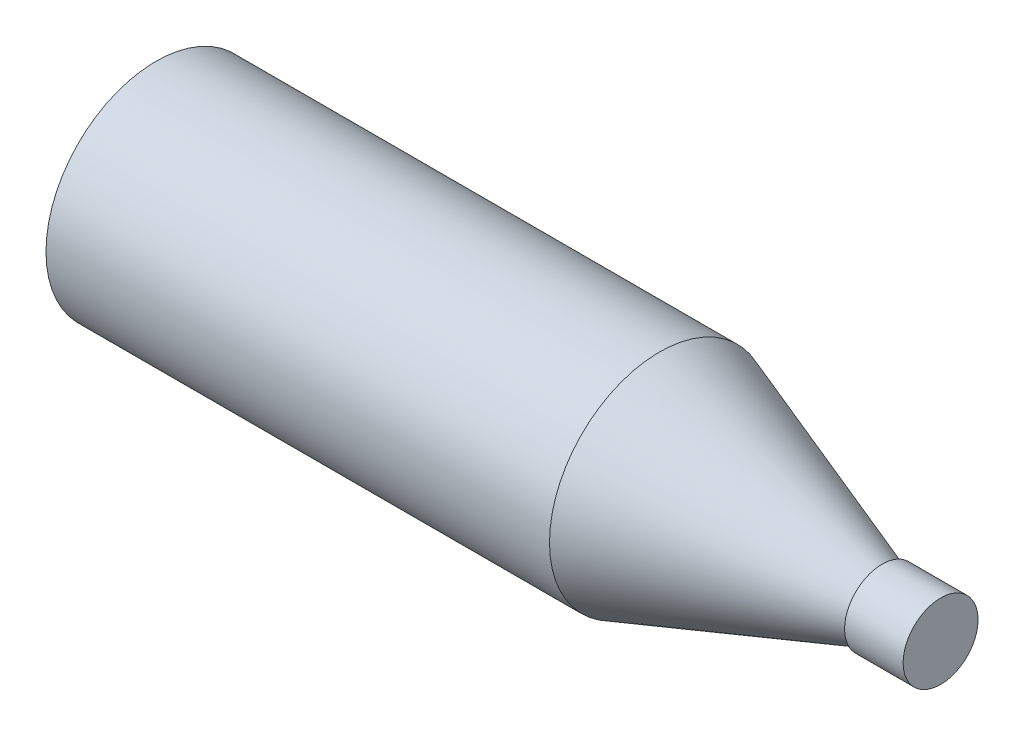
ISO-10303-21;
HEADER;
FILE_DESCRIPTION(('STEP AP214'),'2;1');
FILE_NAME('part.step','',(''),(''),'','','');
FILE_SCHEMA(('AUTOMOTIVE_DESIGN { 1 0 10303 214 1 1 1 1 }'));
ENDSEC;
DATA;
#1=APPLICATION_CONTEXT('core data for automotive mechanical design processes');
#2=APPLICATION_PROTOCOL_DEFINITION('international standard','automotive_design',2000,#1);
#3=PRODUCT_CONTEXT('',#1,'mechanical');
#4=PRODUCT('Part','Part','',(#3));
#5=PRODUCT_RELATED_PRODUCT_CATEGORY('part','',(#4));
#6=PRODUCT_DEFINITION_FORMATION('','',#4);
#7=PRODUCT_DEFINITION_CONTEXT('part definition',#1,'design');
#8=PRODUCT_DEFINITION('design','',#6,#7);
#9=PRODUCT_DEFINITION_SHAPE('','',#8);
#10=(LENGTH_UNIT() NAMED_UNIT(*) SI_UNIT(.MILLI.,.METRE.));
#11=(NAMED_UNIT(*) PLANE_ANGLE_UNIT() SI_UNIT($,.RADIAN.));
#12=(NAMED_UNIT(*) SI_UNIT($,.STERADIAN.) SOLID_ANGLE_UNIT());
#13=UNCERTAINTY_MEASURE_WITH_UNIT(LENGTH_MEASURE(1.E-05),#10,'distance_accuracy_value','');
#14=(GEOMETRIC_REPRESENTATION_CONTEXT(3) GLOBAL_UNCERTAINTY_ASSIGNED_CONTEXT((#13)) GLOBAL_UNIT_ASSIGNED_CONTEXT((#10,
#11,#12)) REPRESENTATION_CONTEXT('',''));
#15=CARTESIAN_POINT('',(0.,0.,0.));
#16=DIRECTION('',(0.,0.,1.));
#17=DIRECTION('',(1.,0.,0.));
#18=AXIS2_PLACEMENT_3D('',#15,#16,#17);
#19=CARTESIAN_POINT('',(-50.7749378945587,0.,0.));
#20=DIRECTION('',(1.,0.,0.));
#21=DIRECTION('',(0.,0.,-1.));
#22=AXIS2_PLACEMENT_3D('',#19,#20,#21);
#23=PLANE('',#22);
#24=CARTESIAN_POINT('',(-50.7749378945587,0.,0.));
#25=DIRECTION('',(-1.,0.,0.));
#26=DIRECTION('',(0.,0.,1.));
#27=AXIS2_PLACEMENT_3D('',#24,#25,#26);
#28=CIRCLE('',#27,47.);
#29=CARTESIAN_POINT('',(-50.7749378945587,0.,47.));
#30=VERTEX_POINT('',#29);
#31=EDGE_CURVE('E10',#30,#30,#28,.T.);
#32=ORIENTED_EDGE('',*,*,#31,.T.);
#33=EDGE_LOOP('',(#32));
#34=FACE_BOUND('',#33,.T.);
#35=ADVANCED_FACE('F31',(#34),#23,.F.);
#36=CARTESIAN_POINT('',(-50.7749378945587,0.,0.));
#37=DIRECTION('',(-1.,0.,0.));
#38=DIRECTION('',(0.,0.,1.));
#39=AXIS2_PLACEMENT_3D('',#36,#37,#38);
#40=CYLINDRICAL_SURFACE('',#39,47.);
#41=ORIENTED_EDGE('',*,*,#31,.F.);
#42=EDGE_LOOP('',(#41));
#43=FACE_BOUND('',#42,.T.);
#44=CARTESIAN_POINT('',(164.225062105441,0.,0.));
#45=DIRECTION('',(-1.,0.,0.));
#46=DIRECTION('',(0.,0.,1.));
#47=AXIS2_PLACEMENT_3D('',#44,#45,#46);
#48=CIRCLE('',#47,47.);
#49=CARTESIAN_POINT('',(164.225062105441,0.,47.));
#50=VERTEX_POINT('',#49);
#51=EDGE_CURVE('E37',#50,#50,#48,.T.);
#52=ORIENTED_EDGE('',*,*,#51,.T.);
#53=EDGE_LOOP('',(#52));
#54=FACE_BOUND('',#53,.T.);
#55=ADVANCED_FACE('F66',(#43,#54),#40,.T.);
#56=CARTESIAN_POINT('',(259.225062105441,0.,0.));
#57=DIRECTION('',(-1.,0.,0.));
#58=DIRECTION('',(0.,0.,1.));
#59=AXIS2_PLACEMENT_3D('',#56,#57,#58);
#60=CONICAL_SURFACE('',#59,13.5,0.339017284064526);
#61=ORIENTED_EDGE('',*,*,#51,.F.);
#62=EDGE_LOOP('',(#61));
#63=FACE_BOUND('',#62,.T.);
#64=CARTESIAN_POINT('',(259.225062105441,0.,0.));
#65=DIRECTION('',(-1.,0.,0.));
#66=DIRECTION('',(0.,0.,1.));
#67=AXIS2_PLACEMENT_3D('',#64,#65,#66);
#68=CIRCLE('',#67,13.5);
#69=CARTESIAN_POINT('',(259.225062105441,0.,13.5));
#70=VERTEX_POINT('',#69);
#71=EDGE_CURVE('E41',#70,#70,#68,.T.);
#72=ORIENTED_EDGE('',*,*,#71,.T.);
#73=EDGE_LOOP('',(#72));
#74=FACE_BOUND('',#73,.T.);
#75=ADVANCED_FACE('F70',(#63,#74),#60,.T.);
#76=CARTESIAN_POINT('',(259.225062105441,13.5,0.));
#77=DIRECTION('',(1.,0.,0.));
#78=DIRECTION('',(0.,0.,-1.));
#79=AXIS2_PLACEMENT_3D('',#76,#77,#78);
#80=PLANE('',#79);
#81=ORIENTED_EDGE('',*,*,#71,.F.);
#82=EDGE_LOOP('',(#81));
#83=FACE_BOUND('',#82,.T.);
#84=CARTESIAN_POINT('',(259.225062105441,0.,0.));
#85=DIRECTION('',(-1.,0.,0.));
#86=DIRECTION('',(0.,0.,1.));
#87=AXIS2_PLACEMENT_3D('',#84,#85,#86);
#88=CIRCLE('',#87,16.);
#89=CARTESIAN_POINT('',(259.225062105441,0.,16.));
#90=VERTEX_POINT('',#89);
#91=EDGE_CURVE('E45',#90,#90,#88,.T.);
#92=ORIENTED_EDGE('',*,*,#91,.T.);
#93=EDGE_LOOP('',(#92));
#94=FACE_BOUND('',#93,.T.);
#95=ADVANCED_FACE('F62',(#83,#94),#80,.F.);
#96=CARTESIAN_POINT('',(-50.7749378945587,0.,0.));
#97=DIRECTION('',(-1.,0.,0.));
#98=DIRECTION('',(0.,0.,1.));
#99=AXIS2_PLACEMENT_3D('',#96,#97,#98);
#100=CYLINDRICAL_SURFACE('',#99,16.);
#101=ORIENTED_EDGE('',*,*,#91,.F.);
#102=EDGE_LOOP('',(#101));
#103=FACE_BOUND('',#102,.T.);
#104=CARTESIAN_POINT('',(284.225062105441,0.,0.));
#105=DIRECTION('',(-1.,0.,0.));
#106=DIRECTION('',(0.,0.,1.));
#107=AXIS2_PLACEMENT_3D('',#104,#105,#106);
#108=CIRCLE('',#107,16.);
#109=CARTESIAN_POINT('',(284.225062105441,0.,16.));
#110=VERTEX_POINT('',#109);
#111=EDGE_CURVE('E50',#110,#110,#108,.T.);
#112=ORIENTED_EDGE('',*,*,#111,.T.);
#113=EDGE_LOOP('',(#112));
#114=FACE_BOUND('',#113,.T.);
#115=ADVANCED_FACE('F54',(#103,#114),#100,.T.);
#116=CARTESIAN_POINT('',(284.225062105441,16.,0.));
#117=DIRECTION('',(-1.,0.,0.));
#118=DIRECTION('',(0.,0.,1.));
#119=AXIS2_PLACEMENT_3D('',#116,#117,#118);
#120=PLANE('',#119);
#121=ORIENTED_EDGE('',*,*,#111,.F.);
#122=EDGE_LOOP('',(#121));
#123=FACE_BOUND('',#122,.T.);
#124=ADVANCED_FACE('F56',(#123),#120,.F.);
#125=CLOSED_SHELL('',(#35,#55,#75,#95,#115,#124));
#126=MANIFOLD_SOLID_BREP('B2',#125);
#127=ADVANCED_BREP_SHAPE_REPRESENTATION('',(#18,#126),#14);
#128=SHAPE_DEFINITION_REPRESENTATION(#9,#127);
ENDSEC;
END-ISO-10303-21;
